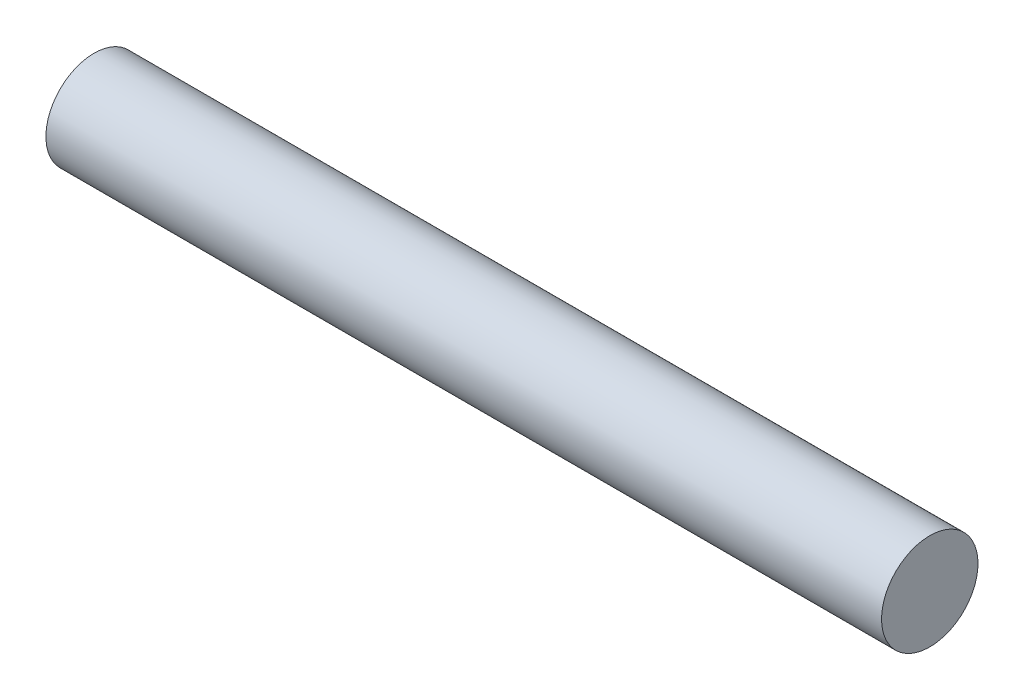
ISO-10303-21;
HEADER;
FILE_DESCRIPTION(('STEP AP214'),'2;1');
FILE_NAME('part.step','',(''),(''),'','','');
FILE_SCHEMA(('AUTOMOTIVE_DESIGN { 1 0 10303 214 1 1 1 1 }'));
ENDSEC;
DATA;
#1=APPLICATION_CONTEXT('core data for automotive mechanical design processes');
#2=APPLICATION_PROTOCOL_DEFINITION('international standard','automotive_design',2000,#1);
#3=PRODUCT_CONTEXT('',#1,'mechanical');
#4=PRODUCT('Part','Part','',(#3));
#5=PRODUCT_RELATED_PRODUCT_CATEGORY('part','',(#4));
#6=PRODUCT_DEFINITION_FORMATION('','',#4);
#7=PRODUCT_DEFINITION_CONTEXT('part definition',#1,'design');
#8=PRODUCT_DEFINITION('design','',#6,#7);
#9=PRODUCT_DEFINITION_SHAPE('','',#8);
#10=(LENGTH_UNIT() NAMED_UNIT(*) SI_UNIT(.MILLI.,.METRE.));
#11=(NAMED_UNIT(*) PLANE_ANGLE_UNIT() SI_UNIT($,.RADIAN.));
#12=(NAMED_UNIT(*) SI_UNIT($,.STERADIAN.) SOLID_ANGLE_UNIT());
#13=UNCERTAINTY_MEASURE_WITH_UNIT(LENGTH_MEASURE(1.E-05),#10,'distance_accuracy_value','');
#14=(GEOMETRIC_REPRESENTATION_CONTEXT(3) GLOBAL_UNCERTAINTY_ASSIGNED_CONTEXT((#13)) GLOBAL_UNIT_ASSIGNED_CONTEXT((#10,
#11,#12)) REPRESENTATION_CONTEXT('',''));
#15=CARTESIAN_POINT('',(0.,0.,0.));
#16=DIRECTION('',(0.,0.,1.));
#17=DIRECTION('',(1.,0.,0.));
#18=AXIS2_PLACEMENT_3D('',#15,#16,#17);
#19=CARTESIAN_POINT('',(0.,0.,0.));
#20=DIRECTION('',(1.,0.,0.));
#21=DIRECTION('',(0.,0.,-1.));
#22=AXIS2_PLACEMENT_3D('',#19,#20,#21);
#23=PLANE('',#22);
#24=CARTESIAN_POINT('',(0.,0.,0.));
#25=DIRECTION('',(1.,0.,0.));
#26=DIRECTION('',(0.,0.,-1.));
#27=AXIS2_PLACEMENT_3D('',#24,#25,#26);
#28=CIRCLE('',#27,9.525);
#29=CARTESIAN_POINT('',(0.,0.,-9.525));
#30=VERTEX_POINT('',#29);
#31=EDGE_CURVE('E39',#30,#30,#28,.T.);
#32=ORIENTED_EDGE('',*,*,#31,.F.);
#33=EDGE_LOOP('',(#32));
#34=FACE_BOUND('',#33,.T.);
#35=ADVANCED_FACE('F32',(#34),#23,.F.);
#36=CARTESIAN_POINT('',(165.1,0.,0.));
#37=DIRECTION('',(1.,0.,0.));
#38=DIRECTION('',(0.,0.,-1.));
#39=AXIS2_PLACEMENT_3D('',#36,#37,#38);
#40=PLANE('',#39);
#41=CARTESIAN_POINT('',(165.1,0.,0.));
#42=DIRECTION('',(1.,0.,0.));
#43=DIRECTION('',(0.,0.,-1.));
#44=AXIS2_PLACEMENT_3D('',#41,#42,#43);
#45=CIRCLE('',#44,9.525);
#46=CARTESIAN_POINT('',(165.1,0.,-9.525));
#47=VERTEX_POINT('',#46);
#48=EDGE_CURVE('E11',#47,#47,#45,.T.);
#49=ORIENTED_EDGE('',*,*,#48,.T.);
#50=EDGE_LOOP('',(#49));
#51=FACE_BOUND('',#50,.T.);
#52=ADVANCED_FACE('F46',(#51),#40,.T.);
#53=CARTESIAN_POINT('',(0.,0.,0.));
#54=DIRECTION('',(1.,0.,0.));
#55=DIRECTION('',(0.,0.,-1.));
#56=AXIS2_PLACEMENT_3D('',#53,#54,#55);
#57=CYLINDRICAL_SURFACE('',#56,9.525);
#58=ORIENTED_EDGE('',*,*,#48,.F.);
#59=EDGE_LOOP('',(#58));
#60=FACE_BOUND('',#59,.T.);
#61=ORIENTED_EDGE('',*,*,#31,.T.);
#62=EDGE_LOOP('',(#61));
#63=FACE_BOUND('',#62,.T.);
#64=ADVANCED_FACE('F48',(#60,#63),#57,.T.);
#65=CLOSED_SHELL('',(#35,#52,#64));
#66=MANIFOLD_SOLID_BREP('B2',#65);
#67=ADVANCED_BREP_SHAPE_REPRESENTATION('',(#18,#66),#14);
#68=SHAPE_DEFINITION_REPRESENTATION(#9,#67);
ENDSEC;
END-ISO-10303-21;
